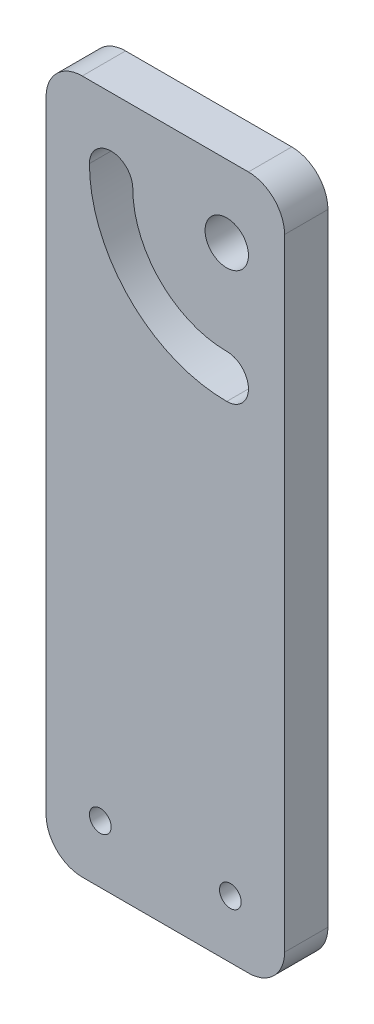
ISO-10303-21;
HEADER;
FILE_DESCRIPTION(('STEP AP214'),'2;1');
FILE_NAME('part.step','',(''),(''),'','','');
FILE_SCHEMA(('AUTOMOTIVE_DESIGN { 1 0 10303 214 1 1 1 1 }'));
ENDSEC;
DATA;
#1=APPLICATION_CONTEXT('core data for automotive mechanical design processes');
#2=APPLICATION_PROTOCOL_DEFINITION('international standard','automotive_design',2000,#1);
#3=PRODUCT_CONTEXT('',#1,'mechanical');
#4=PRODUCT('Part','Part','',(#3));
#5=PRODUCT_RELATED_PRODUCT_CATEGORY('part','',(#4));
#6=PRODUCT_DEFINITION_FORMATION('','',#4);
#7=PRODUCT_DEFINITION_CONTEXT('part definition',#1,'design');
#8=PRODUCT_DEFINITION('design','',#6,#7);
#9=PRODUCT_DEFINITION_SHAPE('','',#8);
#10=(LENGTH_UNIT() NAMED_UNIT(*) SI_UNIT(.MILLI.,.METRE.));
#11=(NAMED_UNIT(*) PLANE_ANGLE_UNIT() SI_UNIT($,.RADIAN.));
#12=(NAMED_UNIT(*) SI_UNIT($,.STERADIAN.) SOLID_ANGLE_UNIT());
#13=UNCERTAINTY_MEASURE_WITH_UNIT(LENGTH_MEASURE(1.E-05),#10,'distance_accuracy_value','');
#14=(GEOMETRIC_REPRESENTATION_CONTEXT(3) GLOBAL_UNCERTAINTY_ASSIGNED_CONTEXT((#13)) GLOBAL_UNIT_ASSIGNED_CONTEXT((#10,
#11,#12)) REPRESENTATION_CONTEXT('',''));
#15=CARTESIAN_POINT('',(0.,0.,0.));
#16=DIRECTION('',(0.,0.,1.));
#17=DIRECTION('',(1.,0.,0.));
#18=AXIS2_PLACEMENT_3D('',#15,#16,#17);
#19=CARTESIAN_POINT('',(5.,-41.,6.));
#20=DIRECTION('',(0.,0.,-1.));
#21=DIRECTION('',(-1.,0.,0.));
#22=AXIS2_PLACEMENT_3D('',#19,#20,#21);
#23=PLANE('',#22);
#24=CARTESIAN_POINT('',(25.,40.,6.));
#25=DIRECTION('',(0.,0.,1.));
#26=DIRECTION('',(1.,0.,0.));
#27=AXIS2_PLACEMENT_3D('',#24,#25,#26);
#28=CIRCLE('',#27,3.);
#29=CARTESIAN_POINT('',(28.,40.,6.));
#30=VERTEX_POINT('',#29);
#31=EDGE_CURVE('E161',#30,#30,#28,.T.);
#32=ORIENTED_EDGE('',*,*,#31,.F.);
#33=EDGE_LOOP('',(#32));
#34=FACE_BOUND('',#33,.T.);
#35=CARTESIAN_POINT('',(25.5,-38.,6.));
#36=DIRECTION('',(0.,0.,1.));
#37=DIRECTION('',(1.,0.,0.));
#38=AXIS2_PLACEMENT_3D('',#35,#36,#37);
#39=CIRCLE('',#38,1.5);
#40=CARTESIAN_POINT('',(27.,-38.,6.));
#41=VERTEX_POINT('',#40);
#42=EDGE_CURVE('E167',#41,#41,#39,.T.);
#43=ORIENTED_EDGE('',*,*,#42,.F.);
#44=EDGE_LOOP('',(#43));
#45=FACE_BOUND('',#44,.T.);
#46=CARTESIAN_POINT('',(5.,-41.,6.));
#47=DIRECTION('',(0.,0.,1.));
#48=DIRECTION('',(-1.,0.,0.));
#49=AXIS2_PLACEMENT_3D('',#46,#47,#48);
#50=CIRCLE('',#49,5.);
#51=CARTESIAN_POINT('',(0.,-41.,6.));
#52=VERTEX_POINT('',#51);
#53=CARTESIAN_POINT('',(5.00000000000004,-46.,6.));
#54=VERTEX_POINT('',#53);
#55=EDGE_CURVE('E173',#52,#54,#50,.T.);
#56=ORIENTED_EDGE('',*,*,#55,.T.);
#57=DIRECTION('',(1.,0.,0.));
#58=VECTOR('',#57,1.);
#59=CARTESIAN_POINT('',(28.,-46.,6.));
#60=LINE('',#59,#58);
#61=CARTESIAN_POINT('',(28.,-46.,6.));
#62=VERTEX_POINT('',#61);
#63=EDGE_CURVE('E176',#54,#62,#60,.T.);
#64=ORIENTED_EDGE('',*,*,#63,.T.);
#65=CARTESIAN_POINT('',(28.,-41.,6.));
#66=DIRECTION('',(0.,0.,1.));
#67=DIRECTION('',(-1.,0.,0.));
#68=AXIS2_PLACEMENT_3D('',#65,#66,#67);
#69=CIRCLE('',#68,5.);
#70=CARTESIAN_POINT('',(33.,-41.,6.));
#71=VERTEX_POINT('',#70);
#72=EDGE_CURVE('E179',#62,#71,#69,.T.);
#73=ORIENTED_EDGE('',*,*,#72,.T.);
#74=DIRECTION('',(0.,1.,0.));
#75=VECTOR('',#74,1.);
#76=CARTESIAN_POINT('',(33.,45.,6.));
#77=LINE('',#76,#75);
#78=CARTESIAN_POINT('',(33.,45.,6.));
#79=VERTEX_POINT('',#78);
#80=EDGE_CURVE('E181',#71,#79,#77,.T.);
#81=ORIENTED_EDGE('',*,*,#80,.T.);
#82=CARTESIAN_POINT('',(28.,45.,6.));
#83=DIRECTION('',(0.,0.,1.));
#84=DIRECTION('',(-1.,0.,0.));
#85=AXIS2_PLACEMENT_3D('',#82,#83,#84);
#86=CIRCLE('',#85,5.);
#87=CARTESIAN_POINT('',(28.,50.,6.));
#88=VERTEX_POINT('',#87);
#89=EDGE_CURVE('E183',#79,#88,#86,.T.);
#90=ORIENTED_EDGE('',*,*,#89,.T.);
#91=DIRECTION('',(-1.,0.,0.));
#92=VECTOR('',#91,1.);
#93=CARTESIAN_POINT('',(5.00000000000004,50.,6.));
#94=LINE('',#93,#92);
#95=CARTESIAN_POINT('',(5.00000000000004,50.,6.));
#96=VERTEX_POINT('',#95);
#97=EDGE_CURVE('E185',#88,#96,#94,.T.);
#98=ORIENTED_EDGE('',*,*,#97,.T.);
#99=CARTESIAN_POINT('',(5.,45.,6.));
#100=DIRECTION('',(0.,0.,1.));
#101=DIRECTION('',(-1.,0.,0.));
#102=AXIS2_PLACEMENT_3D('',#99,#100,#101);
#103=CIRCLE('',#102,5.);
#104=CARTESIAN_POINT('',(0.,45.,6.));
#105=VERTEX_POINT('',#104);
#106=EDGE_CURVE('E187',#96,#105,#103,.T.);
#107=ORIENTED_EDGE('',*,*,#106,.T.);
#108=DIRECTION('',(0.,-1.,0.));
#109=VECTOR('',#108,1.);
#110=CARTESIAN_POINT('',(0.,45.,6.));
#111=LINE('',#110,#109);
#112=EDGE_CURVE('E189',#105,#52,#111,.T.);
#113=ORIENTED_EDGE('',*,*,#112,.T.);
#114=EDGE_LOOP('',(#56,#64,#73,#81,#90,#98,#107,#113));
#115=FACE_BOUND('',#114,.T.);
#116=CARTESIAN_POINT('',(9.,40.0000000000001,6.));
#117=DIRECTION('',(0.,0.,1.));
#118=DIRECTION('',(1.,0.,0.));
#119=AXIS2_PLACEMENT_3D('',#116,#117,#118);
#120=CIRCLE('',#119,3.);
#121=CARTESIAN_POINT('',(12.,40.,6.));
#122=VERTEX_POINT('',#121);
#123=CARTESIAN_POINT('',(6.,40.0000000000001,6.));
#124=VERTEX_POINT('',#123);
#125=EDGE_CURVE('E122',#122,#124,#120,.T.);
#126=ORIENTED_EDGE('',*,*,#125,.F.);
#127=CARTESIAN_POINT('',(25.,40.,6.));
#128=DIRECTION('',(0.,0.,-1.));
#129=DIRECTION('',(1.,0.,0.));
#130=AXIS2_PLACEMENT_3D('',#127,#128,#129);
#131=CIRCLE('',#130,13.);
#132=CARTESIAN_POINT('',(25.,27.,6.));
#133=VERTEX_POINT('',#132);
#134=EDGE_CURVE('E145',#133,#122,#131,.T.);
#135=ORIENTED_EDGE('',*,*,#134,.F.);
#136=CARTESIAN_POINT('',(25.,24.,6.));
#137=DIRECTION('',(0.,0.,1.));
#138=DIRECTION('',(1.,0.,0.));
#139=AXIS2_PLACEMENT_3D('',#136,#137,#138);
#140=CIRCLE('',#139,3.);
#141=CARTESIAN_POINT('',(25.,21.,6.));
#142=VERTEX_POINT('',#141);
#143=EDGE_CURVE('E143',#142,#133,#140,.T.);
#144=ORIENTED_EDGE('',*,*,#143,.F.);
#145=CARTESIAN_POINT('',(25.,40.,6.));
#146=DIRECTION('',(0.,0.,1.));
#147=DIRECTION('',(1.,0.,0.));
#148=AXIS2_PLACEMENT_3D('',#145,#146,#147);
#149=CIRCLE('',#148,19.);
#150=EDGE_CURVE('E130',#124,#142,#149,.T.);
#151=ORIENTED_EDGE('',*,*,#150,.F.);
#152=EDGE_LOOP('',(#126,#135,#144,#151));
#153=FACE_BOUND('',#152,.T.);
#154=CARTESIAN_POINT('',(7.5,-38.,6.));
#155=DIRECTION('',(0.,0.,1.));
#156=DIRECTION('',(-1.,0.,0.));
#157=AXIS2_PLACEMENT_3D('',#154,#155,#156);
#158=CIRCLE('',#157,1.5);
#159=CARTESIAN_POINT('',(5.99999999999999,-38.,6.));
#160=VERTEX_POINT('',#159);
#161=EDGE_CURVE('E151',#160,#160,#158,.T.);
#162=ORIENTED_EDGE('',*,*,#161,.F.);
#163=EDGE_LOOP('',(#162));
#164=FACE_BOUND('',#163,.T.);
#165=ADVANCED_FACE('F33',(#34,#45,#115,#153,#164),#23,.F.);
#166=CARTESIAN_POINT('',(5.,-41.,0.));
#167=DIRECTION('',(0.,0.,-1.));
#168=DIRECTION('',(-1.,0.,0.));
#169=AXIS2_PLACEMENT_3D('',#166,#167,#168);
#170=PLANE('',#169);
#171=CARTESIAN_POINT('',(25.,40.,0.));
#172=DIRECTION('',(0.,0.,-1.));
#173=DIRECTION('',(1.,0.,0.));
#174=AXIS2_PLACEMENT_3D('',#171,#172,#173);
#175=CIRCLE('',#174,13.);
#176=CARTESIAN_POINT('',(25.,27.,0.));
#177=VERTEX_POINT('',#176);
#178=CARTESIAN_POINT('',(12.,40.,0.));
#179=VERTEX_POINT('',#178);
#180=EDGE_CURVE('E131',#177,#179,#175,.T.);
#181=ORIENTED_EDGE('',*,*,#180,.T.);
#182=CARTESIAN_POINT('',(9.,40.0000000000001,0.));
#183=DIRECTION('',(0.,0.,1.));
#184=DIRECTION('',(1.,0.,0.));
#185=AXIS2_PLACEMENT_3D('',#182,#183,#184);
#186=CIRCLE('',#185,3.);
#187=CARTESIAN_POINT('',(6.,40.0000000000001,0.));
#188=VERTEX_POINT('',#187);
#189=EDGE_CURVE('E56',#179,#188,#186,.T.);
#190=ORIENTED_EDGE('',*,*,#189,.T.);
#191=CARTESIAN_POINT('',(25.,40.,0.));
#192=DIRECTION('',(0.,0.,1.));
#193=DIRECTION('',(1.,0.,0.));
#194=AXIS2_PLACEMENT_3D('',#191,#192,#193);
#195=CIRCLE('',#194,19.);
#196=CARTESIAN_POINT('',(25.,21.,0.));
#197=VERTEX_POINT('',#196);
#198=EDGE_CURVE('E137',#188,#197,#195,.T.);
#199=ORIENTED_EDGE('',*,*,#198,.T.);
#200=CARTESIAN_POINT('',(25.,24.,0.));
#201=DIRECTION('',(0.,0.,1.));
#202=DIRECTION('',(1.,0.,0.));
#203=AXIS2_PLACEMENT_3D('',#200,#201,#202);
#204=CIRCLE('',#203,3.);
#205=EDGE_CURVE('E153',#197,#177,#204,.T.);
#206=ORIENTED_EDGE('',*,*,#205,.T.);
#207=EDGE_LOOP('',(#181,#190,#199,#206));
#208=FACE_BOUND('',#207,.T.);
#209=CARTESIAN_POINT('',(25.,40.,0.));
#210=DIRECTION('',(0.,0.,1.));
#211=DIRECTION('',(1.,0.,0.));
#212=AXIS2_PLACEMENT_3D('',#209,#210,#211);
#213=CIRCLE('',#212,3.);
#214=CARTESIAN_POINT('',(28.,40.,0.));
#215=VERTEX_POINT('',#214);
#216=EDGE_CURVE('E138',#215,#215,#213,.T.);
#217=ORIENTED_EDGE('',*,*,#216,.T.);
#218=EDGE_LOOP('',(#217));
#219=FACE_BOUND('',#218,.T.);
#220=CARTESIAN_POINT('',(5.,-41.,0.));
#221=DIRECTION('',(0.,0.,1.));
#222=DIRECTION('',(-1.,0.,0.));
#223=AXIS2_PLACEMENT_3D('',#220,#221,#222);
#224=CIRCLE('',#223,5.);
#225=CARTESIAN_POINT('',(0.,-41.,0.));
#226=VERTEX_POINT('',#225);
#227=CARTESIAN_POINT('',(5.00000000000004,-46.,0.));
#228=VERTEX_POINT('',#227);
#229=EDGE_CURVE('E170',#226,#228,#224,.T.);
#230=ORIENTED_EDGE('',*,*,#229,.F.);
#231=DIRECTION('',(0.,-1.,0.));
#232=VECTOR('',#231,1.);
#233=CARTESIAN_POINT('',(0.,45.,0.));
#234=LINE('',#233,#232);
#235=CARTESIAN_POINT('',(0.,45.,0.));
#236=VERTEX_POINT('',#235);
#237=EDGE_CURVE('E177',#236,#226,#234,.T.);
#238=ORIENTED_EDGE('',*,*,#237,.F.);
#239=CARTESIAN_POINT('',(5.,45.,0.));
#240=DIRECTION('',(0.,0.,1.));
#241=DIRECTION('',(-1.,0.,0.));
#242=AXIS2_PLACEMENT_3D('',#239,#240,#241);
#243=CIRCLE('',#242,5.);
#244=CARTESIAN_POINT('',(5.00000000000004,50.,0.));
#245=VERTEX_POINT('',#244);
#246=EDGE_CURVE('E204',#245,#236,#243,.T.);
#247=ORIENTED_EDGE('',*,*,#246,.F.);
#248=DIRECTION('',(-1.,0.,0.));
#249=VECTOR('',#248,1.);
#250=CARTESIAN_POINT('',(5.00000000000004,50.,0.));
#251=LINE('',#250,#249);
#252=CARTESIAN_POINT('',(28.,50.,0.));
#253=VERTEX_POINT('',#252);
#254=EDGE_CURVE('E202',#253,#245,#251,.T.);
#255=ORIENTED_EDGE('',*,*,#254,.F.);
#256=CARTESIAN_POINT('',(28.,45.,0.));
#257=DIRECTION('',(0.,0.,1.));
#258=DIRECTION('',(-1.,0.,0.));
#259=AXIS2_PLACEMENT_3D('',#256,#257,#258);
#260=CIRCLE('',#259,5.);
#261=CARTESIAN_POINT('',(33.,45.,0.));
#262=VERTEX_POINT('',#261);
#263=EDGE_CURVE('E200',#262,#253,#260,.T.);
#264=ORIENTED_EDGE('',*,*,#263,.F.);
#265=DIRECTION('',(0.,1.,0.));
#266=VECTOR('',#265,1.);
#267=CARTESIAN_POINT('',(33.,45.,0.));
#268=LINE('',#267,#266);
#269=CARTESIAN_POINT('',(33.,-41.,0.));
#270=VERTEX_POINT('',#269);
#271=EDGE_CURVE('E198',#270,#262,#268,.T.);
#272=ORIENTED_EDGE('',*,*,#271,.F.);
#273=CARTESIAN_POINT('',(28.,-41.,0.));
#274=DIRECTION('',(0.,0.,1.));
#275=DIRECTION('',(-1.,0.,0.));
#276=AXIS2_PLACEMENT_3D('',#273,#274,#275);
#277=CIRCLE('',#276,5.);
#278=CARTESIAN_POINT('',(28.,-46.,0.));
#279=VERTEX_POINT('',#278);
#280=EDGE_CURVE('E196',#279,#270,#277,.T.);
#281=ORIENTED_EDGE('',*,*,#280,.F.);
#282=DIRECTION('',(1.,0.,0.));
#283=VECTOR('',#282,1.);
#284=CARTESIAN_POINT('',(28.,-46.,0.));
#285=LINE('',#284,#283);
#286=EDGE_CURVE('E194',#228,#279,#285,.T.);
#287=ORIENTED_EDGE('',*,*,#286,.F.);
#288=EDGE_LOOP('',(#230,#238,#247,#255,#264,#272,#281,#287));
#289=FACE_BOUND('',#288,.T.);
#290=CARTESIAN_POINT('',(25.5,-38.,0.));
#291=DIRECTION('',(0.,0.,1.));
#292=DIRECTION('',(1.,0.,0.));
#293=AXIS2_PLACEMENT_3D('',#290,#291,#292);
#294=CIRCLE('',#293,1.5);
#295=CARTESIAN_POINT('',(27.,-38.,0.));
#296=VERTEX_POINT('',#295);
#297=EDGE_CURVE('E164',#296,#296,#294,.T.);
#298=ORIENTED_EDGE('',*,*,#297,.T.);
#299=EDGE_LOOP('',(#298));
#300=FACE_BOUND('',#299,.T.);
#301=CARTESIAN_POINT('',(7.5,-38.,0.));
#302=DIRECTION('',(0.,0.,1.));
#303=DIRECTION('',(-1.,0.,0.));
#304=AXIS2_PLACEMENT_3D('',#301,#302,#303);
#305=CIRCLE('',#304,1.5);
#306=CARTESIAN_POINT('',(5.99999999999999,-38.,0.));
#307=VERTEX_POINT('',#306);
#308=EDGE_CURVE('E303',#307,#307,#305,.T.);
#309=ORIENTED_EDGE('',*,*,#308,.T.);
#310=EDGE_LOOP('',(#309));
#311=FACE_BOUND('',#310,.T.);
#312=ADVANCED_FACE('F234',(#208,#219,#289,#300,#311),#170,.T.);
#313=CARTESIAN_POINT('',(5.,-41.,6.));
#314=DIRECTION('',(0.,0.,-1.));
#315=DIRECTION('',(-1.,0.,0.));
#316=AXIS2_PLACEMENT_3D('',#313,#314,#315);
#317=CYLINDRICAL_SURFACE('',#316,5.);
#318=ORIENTED_EDGE('',*,*,#229,.T.);
#319=DIRECTION('',(0.,0.,-1.));
#320=VECTOR('',#319,1.);
#321=CARTESIAN_POINT('',(5.00000000000004,-46.,6.));
#322=LINE('',#321,#320);
#323=EDGE_CURVE('E11',#54,#228,#322,.T.);
#324=ORIENTED_EDGE('',*,*,#323,.F.);
#325=ORIENTED_EDGE('',*,*,#55,.F.);
#326=DIRECTION('',(0.,0.,-1.));
#327=VECTOR('',#326,1.);
#328=CARTESIAN_POINT('',(0.,-41.,6.));
#329=LINE('',#328,#327);
#330=EDGE_CURVE('E191',#52,#226,#329,.T.);
#331=ORIENTED_EDGE('',*,*,#330,.T.);
#332=EDGE_LOOP('',(#318,#324,#325,#331));
#333=FACE_BOUND('',#332,.T.);
#334=ADVANCED_FACE('F35',(#333),#317,.T.);
#335=CARTESIAN_POINT('',(28.,-46.,6.));
#336=DIRECTION('',(0.,1.,0.));
#337=DIRECTION('',(-1.,0.,0.));
#338=AXIS2_PLACEMENT_3D('',#335,#336,#337);
#339=PLANE('',#338);
#340=ORIENTED_EDGE('',*,*,#286,.T.);
#341=DIRECTION('',(0.,0.,-1.));
#342=VECTOR('',#341,1.);
#343=CARTESIAN_POINT('',(28.,-46.,6.));
#344=LINE('',#343,#342);
#345=EDGE_CURVE('E41',#62,#279,#344,.T.);
#346=ORIENTED_EDGE('',*,*,#345,.F.);
#347=ORIENTED_EDGE('',*,*,#63,.F.);
#348=ORIENTED_EDGE('',*,*,#323,.T.);
#349=EDGE_LOOP('',(#340,#346,#347,#348));
#350=FACE_BOUND('',#349,.T.);
#351=ADVANCED_FACE('F251',(#350),#339,.F.);
#352=CARTESIAN_POINT('',(28.,-41.,6.));
#353=DIRECTION('',(0.,0.,-1.));
#354=DIRECTION('',(-1.,0.,0.));
#355=AXIS2_PLACEMENT_3D('',#352,#353,#354);
#356=CYLINDRICAL_SURFACE('',#355,5.);
#357=ORIENTED_EDGE('',*,*,#280,.T.);
#358=DIRECTION('',(0.,0.,-1.));
#359=VECTOR('',#358,1.);
#360=CARTESIAN_POINT('',(33.,-41.,6.));
#361=LINE('',#360,#359);
#362=EDGE_CURVE('E221',#71,#270,#361,.T.);
#363=ORIENTED_EDGE('',*,*,#362,.F.);
#364=ORIENTED_EDGE('',*,*,#72,.F.);
#365=ORIENTED_EDGE('',*,*,#345,.T.);
#366=EDGE_LOOP('',(#357,#363,#364,#365));
#367=FACE_BOUND('',#366,.T.);
#368=ADVANCED_FACE('F228',(#367),#356,.T.);
#369=CARTESIAN_POINT('',(33.,45.,6.));
#370=DIRECTION('',(-1.,0.,0.));
#371=DIRECTION('',(0.,-1.,0.));
#372=AXIS2_PLACEMENT_3D('',#369,#370,#371);
#373=PLANE('',#372);
#374=ORIENTED_EDGE('',*,*,#271,.T.);
#375=DIRECTION('',(0.,0.,-1.));
#376=VECTOR('',#375,1.);
#377=CARTESIAN_POINT('',(33.,45.,6.));
#378=LINE('',#377,#376);
#379=EDGE_CURVE('E218',#79,#262,#378,.T.);
#380=ORIENTED_EDGE('',*,*,#379,.F.);
#381=ORIENTED_EDGE('',*,*,#80,.F.);
#382=ORIENTED_EDGE('',*,*,#362,.T.);
#383=EDGE_LOOP('',(#374,#380,#381,#382));
#384=FACE_BOUND('',#383,.T.);
#385=ADVANCED_FACE('F240',(#384),#373,.F.);
#386=CARTESIAN_POINT('',(28.,45.,6.));
#387=DIRECTION('',(0.,0.,-1.));
#388=DIRECTION('',(-1.,0.,0.));
#389=AXIS2_PLACEMENT_3D('',#386,#387,#388);
#390=CYLINDRICAL_SURFACE('',#389,5.);
#391=ORIENTED_EDGE('',*,*,#263,.T.);
#392=DIRECTION('',(0.,0.,-1.));
#393=VECTOR('',#392,1.);
#394=CARTESIAN_POINT('',(28.,50.,6.));
#395=LINE('',#394,#393);
#396=EDGE_CURVE('E215',#88,#253,#395,.T.);
#397=ORIENTED_EDGE('',*,*,#396,.F.);
#398=ORIENTED_EDGE('',*,*,#89,.F.);
#399=ORIENTED_EDGE('',*,*,#379,.T.);
#400=EDGE_LOOP('',(#391,#397,#398,#399));
#401=FACE_BOUND('',#400,.T.);
#402=ADVANCED_FACE('F244',(#401),#390,.T.);
#403=CARTESIAN_POINT('',(5.00000000000004,50.,6.));
#404=DIRECTION('',(0.,-1.,0.));
#405=DIRECTION('',(0.,0.,-1.));
#406=AXIS2_PLACEMENT_3D('',#403,#404,#405);
#407=PLANE('',#406);
#408=ORIENTED_EDGE('',*,*,#254,.T.);
#409=DIRECTION('',(0.,0.,-1.));
#410=VECTOR('',#409,1.);
#411=CARTESIAN_POINT('',(5.00000000000004,50.,6.));
#412=LINE('',#411,#410);
#413=EDGE_CURVE('E212',#96,#245,#412,.T.);
#414=ORIENTED_EDGE('',*,*,#413,.F.);
#415=ORIENTED_EDGE('',*,*,#97,.F.);
#416=ORIENTED_EDGE('',*,*,#396,.T.);
#417=EDGE_LOOP('',(#408,#414,#415,#416));
#418=FACE_BOUND('',#417,.T.);
#419=ADVANCED_FACE('F264',(#418),#407,.F.);
#420=CARTESIAN_POINT('',(5.,45.,6.));
#421=DIRECTION('',(0.,0.,-1.));
#422=DIRECTION('',(-1.,0.,0.));
#423=AXIS2_PLACEMENT_3D('',#420,#421,#422);
#424=CYLINDRICAL_SURFACE('',#423,5.);
#425=ORIENTED_EDGE('',*,*,#246,.T.);
#426=DIRECTION('',(0.,0.,-1.));
#427=VECTOR('',#426,1.);
#428=CARTESIAN_POINT('',(0.,45.,6.));
#429=LINE('',#428,#427);
#430=EDGE_CURVE('E209',#105,#236,#429,.T.);
#431=ORIENTED_EDGE('',*,*,#430,.F.);
#432=ORIENTED_EDGE('',*,*,#106,.F.);
#433=ORIENTED_EDGE('',*,*,#413,.T.);
#434=EDGE_LOOP('',(#425,#431,#432,#433));
#435=FACE_BOUND('',#434,.T.);
#436=ADVANCED_FACE('F262',(#435),#424,.T.);
#437=CARTESIAN_POINT('',(0.,45.,6.));
#438=DIRECTION('',(1.,0.,0.));
#439=DIRECTION('',(0.,0.,-1.));
#440=AXIS2_PLACEMENT_3D('',#437,#438,#439);
#441=PLANE('',#440);
#442=ORIENTED_EDGE('',*,*,#237,.T.);
#443=ORIENTED_EDGE('',*,*,#330,.F.);
#444=ORIENTED_EDGE('',*,*,#112,.F.);
#445=ORIENTED_EDGE('',*,*,#430,.T.);
#446=EDGE_LOOP('',(#442,#443,#444,#445));
#447=FACE_BOUND('',#446,.T.);
#448=ADVANCED_FACE('F257',(#447),#441,.F.);
#449=CARTESIAN_POINT('',(25.5,-38.,6.));
#450=DIRECTION('',(0.,0.,-1.));
#451=DIRECTION('',(-1.,0.,0.));
#452=AXIS2_PLACEMENT_3D('',#449,#450,#451);
#453=CYLINDRICAL_SURFACE('',#452,1.5);
#454=ORIENTED_EDGE('',*,*,#42,.T.);
#455=EDGE_LOOP('',(#454));
#456=FACE_BOUND('',#455,.T.);
#457=ORIENTED_EDGE('',*,*,#297,.F.);
#458=EDGE_LOOP('',(#457));
#459=FACE_BOUND('',#458,.T.);
#460=ADVANCED_FACE('F284',(#456,#459),#453,.F.);
#461=CARTESIAN_POINT('',(25.,40.,6.));
#462=DIRECTION('',(0.,0.,-1.));
#463=DIRECTION('',(-1.,0.,0.));
#464=AXIS2_PLACEMENT_3D('',#461,#462,#463);
#465=CYLINDRICAL_SURFACE('',#464,3.);
#466=ORIENTED_EDGE('',*,*,#31,.T.);
#467=EDGE_LOOP('',(#466));
#468=FACE_BOUND('',#467,.T.);
#469=ORIENTED_EDGE('',*,*,#216,.F.);
#470=EDGE_LOOP('',(#469));
#471=FACE_BOUND('',#470,.T.);
#472=ADVANCED_FACE('F291',(#468,#471),#465,.F.);
#473=CARTESIAN_POINT('',(9.,40.0000000000001,6.));
#474=DIRECTION('',(0.,0.,-1.));
#475=DIRECTION('',(-1.,0.,0.));
#476=AXIS2_PLACEMENT_3D('',#473,#474,#475);
#477=CYLINDRICAL_SURFACE('',#476,3.);
#478=ORIENTED_EDGE('',*,*,#189,.F.);
#479=DIRECTION('',(0.,0.,-1.));
#480=VECTOR('',#479,1.);
#481=CARTESIAN_POINT('',(12.,40.,6.));
#482=LINE('',#481,#480);
#483=EDGE_CURVE('E126',#122,#179,#482,.T.);
#484=ORIENTED_EDGE('',*,*,#483,.F.);
#485=ORIENTED_EDGE('',*,*,#125,.T.);
#486=DIRECTION('',(0.,0.,-1.));
#487=VECTOR('',#486,1.);
#488=CARTESIAN_POINT('',(6.,40.0000000000001,6.));
#489=LINE('',#488,#487);
#490=EDGE_CURVE('E125',#124,#188,#489,.T.);
#491=ORIENTED_EDGE('',*,*,#490,.T.);
#492=EDGE_LOOP('',(#478,#484,#485,#491));
#493=FACE_BOUND('',#492,.T.);
#494=ADVANCED_FACE('F124',(#493),#477,.F.);
#495=CARTESIAN_POINT('',(25.,40.,6.));
#496=DIRECTION('',(0.,0.,-1.));
#497=DIRECTION('',(-1.,0.,0.));
#498=AXIS2_PLACEMENT_3D('',#495,#496,#497);
#499=CYLINDRICAL_SURFACE('',#498,19.);
#500=ORIENTED_EDGE('',*,*,#198,.F.);
#501=ORIENTED_EDGE('',*,*,#490,.F.);
#502=ORIENTED_EDGE('',*,*,#150,.T.);
#503=DIRECTION('',(0.,0.,-1.));
#504=VECTOR('',#503,1.);
#505=CARTESIAN_POINT('',(25.,21.,6.));
#506=LINE('',#505,#504);
#507=EDGE_CURVE('E139',#142,#197,#506,.T.);
#508=ORIENTED_EDGE('',*,*,#507,.T.);
#509=EDGE_LOOP('',(#500,#501,#502,#508));
#510=FACE_BOUND('',#509,.T.);
#511=ADVANCED_FACE('F134',(#510),#499,.F.);
#512=CARTESIAN_POINT('',(25.,24.,6.));
#513=DIRECTION('',(0.,0.,-1.));
#514=DIRECTION('',(-1.,0.,0.));
#515=AXIS2_PLACEMENT_3D('',#512,#513,#514);
#516=CYLINDRICAL_SURFACE('',#515,3.);
#517=ORIENTED_EDGE('',*,*,#205,.F.);
#518=ORIENTED_EDGE('',*,*,#507,.F.);
#519=ORIENTED_EDGE('',*,*,#143,.T.);
#520=DIRECTION('',(0.,0.,-1.));
#521=VECTOR('',#520,1.);
#522=CARTESIAN_POINT('',(25.,27.,6.));
#523=LINE('',#522,#521);
#524=EDGE_CURVE('E48',#133,#177,#523,.T.);
#525=ORIENTED_EDGE('',*,*,#524,.T.);
#526=EDGE_LOOP('',(#517,#518,#519,#525));
#527=FACE_BOUND('',#526,.T.);
#528=ADVANCED_FACE('F316',(#527),#516,.F.);
#529=CARTESIAN_POINT('',(25.,40.,6.));
#530=DIRECTION('',(0.,0.,-1.));
#531=DIRECTION('',(-1.,0.,0.));
#532=AXIS2_PLACEMENT_3D('',#529,#530,#531);
#533=CYLINDRICAL_SURFACE('',#532,13.);
#534=ORIENTED_EDGE('',*,*,#180,.F.);
#535=ORIENTED_EDGE('',*,*,#524,.F.);
#536=ORIENTED_EDGE('',*,*,#134,.T.);
#537=ORIENTED_EDGE('',*,*,#483,.T.);
#538=EDGE_LOOP('',(#534,#535,#536,#537));
#539=FACE_BOUND('',#538,.T.);
#540=ADVANCED_FACE('F311',(#539),#533,.T.);
#541=CARTESIAN_POINT('',(7.5,-38.,6.));
#542=DIRECTION('',(0.,0.,-1.));
#543=DIRECTION('',(-1.,0.,0.));
#544=AXIS2_PLACEMENT_3D('',#541,#542,#543);
#545=CYLINDRICAL_SURFACE('',#544,1.5);
#546=ORIENTED_EDGE('',*,*,#161,.T.);
#547=EDGE_LOOP('',(#546));
#548=FACE_BOUND('',#547,.T.);
#549=ORIENTED_EDGE('',*,*,#308,.F.);
#550=EDGE_LOOP('',(#549));
#551=FACE_BOUND('',#550,.T.);
#552=ADVANCED_FACE('F309',(#548,#551),#545,.F.);
#553=CLOSED_SHELL('',(#165,#312,#334,#351,#368,#385,#402,#419,#436,#448,#460,#472,#494,#511,
#528,#540,#552));
#554=MANIFOLD_SOLID_BREP('B2',#553);
#555=ADVANCED_BREP_SHAPE_REPRESENTATION('',(#18,#554),#14);
#556=SHAPE_DEFINITION_REPRESENTATION(#9,#555);
ENDSEC;
END-ISO-10303-21;
